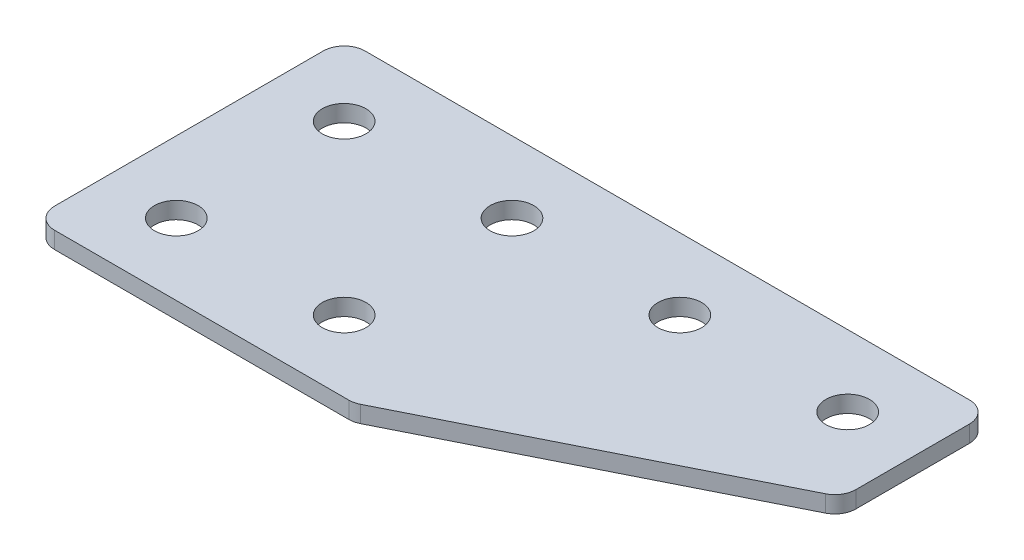
ISO-10303-21;
HEADER;
FILE_DESCRIPTION(('STEP AP214'),'2;1');
FILE_NAME('part.step','',(''),(''),'','','');
FILE_SCHEMA(('AUTOMOTIVE_DESIGN { 1 0 10303 214 1 1 1 1 }'));
ENDSEC;
DATA;
#1=APPLICATION_CONTEXT('core data for automotive mechanical design processes');
#2=APPLICATION_PROTOCOL_DEFINITION('international standard','automotive_design',2000,#1);
#3=PRODUCT_CONTEXT('',#1,'mechanical');
#4=PRODUCT('Part','Part','',(#3));
#5=PRODUCT_RELATED_PRODUCT_CATEGORY('part','',(#4));
#6=PRODUCT_DEFINITION_FORMATION('','',#4);
#7=PRODUCT_DEFINITION_CONTEXT('part definition',#1,'design');
#8=PRODUCT_DEFINITION('design','',#6,#7);
#9=PRODUCT_DEFINITION_SHAPE('','',#8);
#10=(LENGTH_UNIT() NAMED_UNIT(*) SI_UNIT(.MILLI.,.METRE.));
#11=(NAMED_UNIT(*) PLANE_ANGLE_UNIT() SI_UNIT($,.RADIAN.));
#12=(NAMED_UNIT(*) SI_UNIT($,.STERADIAN.) SOLID_ANGLE_UNIT());
#13=UNCERTAINTY_MEASURE_WITH_UNIT(LENGTH_MEASURE(1.E-05),#10,'distance_accuracy_value','');
#14=(GEOMETRIC_REPRESENTATION_CONTEXT(3) GLOBAL_UNCERTAINTY_ASSIGNED_CONTEXT((#13)) GLOBAL_UNIT_ASSIGNED_CONTEXT((#10,
#11,#12)) REPRESENTATION_CONTEXT('',''));
#15=CARTESIAN_POINT('',(0.,0.,0.));
#16=DIRECTION('',(0.,0.,1.));
#17=DIRECTION('',(1.,0.,0.));
#18=AXIS2_PLACEMENT_3D('',#15,#16,#17);
#19=CARTESIAN_POINT('',(-21.2079098669346,0.841431359650869,-10.6332222330343));
#20=DIRECTION('',(0.,-1.,0.));
#21=DIRECTION('',(0.,0.,-1.));
#22=AXIS2_PLACEMENT_3D('',#19,#20,#21);
#23=PLANE('',#22);
#24=CARTESIAN_POINT('',(-11.2079098669345,0.841431359650869,9.36677776696574));
#25=DIRECTION('',(0.,1.,0.));
#26=DIRECTION('',(0.,0.,1.));
#27=AXIS2_PLACEMENT_3D('',#24,#25,#26);
#28=CIRCLE('',#27,2.6);
#29=CARTESIAN_POINT('',(-11.2079098669345,0.841431359650869,11.9667777669657));
#30=VERTEX_POINT('',#29);
#31=EDGE_CURVE('E253',#30,#30,#28,.T.);
#32=ORIENTED_EDGE('',*,*,#31,.T.);
#33=EDGE_LOOP('',(#32));
#34=FACE_BOUND('',#33,.T.);
#35=CARTESIAN_POINT('',(-31.2079098669346,0.841431359650869,9.36677776696574));
#36=DIRECTION('',(0.,1.,0.));
#37=DIRECTION('',(0.,0.,1.));
#38=AXIS2_PLACEMENT_3D('',#35,#36,#37);
#39=CIRCLE('',#38,2.6);
#40=CARTESIAN_POINT('',(-31.2079098669346,0.841431359650869,11.9667777669657));
#41=VERTEX_POINT('',#40);
#42=EDGE_CURVE('E261',#41,#41,#39,.T.);
#43=ORIENTED_EDGE('',*,*,#42,.T.);
#44=EDGE_LOOP('',(#43));
#45=FACE_BOUND('',#44,.T.);
#46=CARTESIAN_POINT('',(28.7920901330654,0.841431359650869,-10.6332222330343));
#47=DIRECTION('',(0.,1.,0.));
#48=DIRECTION('',(0.,0.,1.));
#49=AXIS2_PLACEMENT_3D('',#46,#47,#48);
#50=CIRCLE('',#49,2.6);
#51=CARTESIAN_POINT('',(28.7920901330654,0.841431359650869,-8.03322223303427));
#52=VERTEX_POINT('',#51);
#53=EDGE_CURVE('E267',#52,#52,#50,.T.);
#54=ORIENTED_EDGE('',*,*,#53,.T.);
#55=EDGE_LOOP('',(#54));
#56=FACE_BOUND('',#55,.T.);
#57=CARTESIAN_POINT('',(8.79209013306545,0.841431359650869,-10.6332222330343));
#58=DIRECTION('',(0.,1.,0.));
#59=DIRECTION('',(0.,0.,1.));
#60=AXIS2_PLACEMENT_3D('',#57,#58,#59);
#61=CIRCLE('',#60,2.6);
#62=CARTESIAN_POINT('',(8.79209013306545,0.841431359650869,-8.03322223303427));
#63=VERTEX_POINT('',#62);
#64=EDGE_CURVE('E273',#63,#63,#61,.T.);
#65=ORIENTED_EDGE('',*,*,#64,.T.);
#66=EDGE_LOOP('',(#65));
#67=FACE_BOUND('',#66,.T.);
#68=CARTESIAN_POINT('',(-11.2079098669345,0.841431359650869,-10.6332222330343));
#69=DIRECTION('',(0.,1.,0.));
#70=DIRECTION('',(0.,0.,1.));
#71=AXIS2_PLACEMENT_3D('',#68,#69,#70);
#72=CIRCLE('',#71,2.6);
#73=CARTESIAN_POINT('',(-11.2079098669345,0.841431359650869,-8.03322223303426));
#74=VERTEX_POINT('',#73);
#75=EDGE_CURVE('E279',#74,#74,#72,.T.);
#76=ORIENTED_EDGE('',*,*,#75,.T.);
#77=EDGE_LOOP('',(#76));
#78=FACE_BOUND('',#77,.T.);
#79=CARTESIAN_POINT('',(-31.2079098669346,0.841431359650869,-10.6332222330343));
#80=DIRECTION('',(0.,1.,0.));
#81=DIRECTION('',(0.,0.,1.));
#82=AXIS2_PLACEMENT_3D('',#79,#80,#81);
#83=CIRCLE('',#82,2.6);
#84=CARTESIAN_POINT('',(-31.2079098669346,0.841431359650869,-8.03322223303426));
#85=VERTEX_POINT('',#84);
#86=EDGE_CURVE('E176',#85,#85,#83,.T.);
#87=ORIENTED_EDGE('',*,*,#86,.T.);
#88=EDGE_LOOP('',(#87));
#89=FACE_BOUND('',#88,.T.);
#90=DIRECTION('',(1.,0.,0.));
#91=VECTOR('',#90,1.);
#92=CARTESIAN_POINT('',(-39.7079098669346,0.841431359650869,17.8667777669657));
#93=LINE('',#92,#91);
#94=CARTESIAN_POINT('',(-37.2079098669346,0.841431359650869,17.8667777669657));
#95=VERTEX_POINT('',#94);
#96=CARTESIAN_POINT('',(-2.15218177693365,0.841431359650869,17.8667777669657));
#97=VERTEX_POINT('',#96);
#98=EDGE_CURVE('E165',#95,#97,#93,.T.);
#99=ORIENTED_EDGE('',*,*,#98,.F.);
#100=CARTESIAN_POINT('',(-37.2079098669346,0.841431359650869,15.3667777669657));
#101=DIRECTION('',(0.,-1.,0.));
#102=DIRECTION('',(0.,0.,-1.));
#103=AXIS2_PLACEMENT_3D('',#100,#101,#102);
#104=CIRCLE('',#103,2.5);
#105=CARTESIAN_POINT('',(-39.7079098669346,0.841431359650869,15.3667777669657));
#106=VERTEX_POINT('',#105);
#107=EDGE_CURVE('E146',#95,#106,#104,.T.);
#108=ORIENTED_EDGE('',*,*,#107,.T.);
#109=DIRECTION('',(0.,0.,1.));
#110=VECTOR('',#109,1.);
#111=CARTESIAN_POINT('',(-39.7079098669346,0.841431359650869,-19.1332222330343));
#112=LINE('',#111,#110);
#113=CARTESIAN_POINT('',(-39.7079098669346,0.841431359650869,-16.6332222330343));
#114=VERTEX_POINT('',#113);
#115=EDGE_CURVE('E163',#114,#106,#112,.T.);
#116=ORIENTED_EDGE('',*,*,#115,.F.);
#117=CARTESIAN_POINT('',(-37.2079098669346,0.841431359650869,-16.6332222330343));
#118=DIRECTION('',(0.,-1.,0.));
#119=DIRECTION('',(0.,0.,-1.));
#120=AXIS2_PLACEMENT_3D('',#117,#118,#119);
#121=CIRCLE('',#120,2.5);
#122=CARTESIAN_POINT('',(-37.2079098669346,0.841431359650869,-19.1332222330343));
#123=VERTEX_POINT('',#122);
#124=EDGE_CURVE('E117',#114,#123,#121,.T.);
#125=ORIENTED_EDGE('',*,*,#124,.T.);
#126=DIRECTION('',(-1.,0.,0.));
#127=VECTOR('',#126,1.);
#128=CARTESIAN_POINT('',(37.2920901330654,0.841431359650869,-19.1332222330343));
#129=LINE('',#128,#127);
#130=CARTESIAN_POINT('',(34.7920901330654,0.841431359650869,-19.1332222330343));
#131=VERTEX_POINT('',#130);
#132=EDGE_CURVE('E161',#131,#123,#129,.T.);
#133=ORIENTED_EDGE('',*,*,#132,.F.);
#134=CARTESIAN_POINT('',(34.7920901330654,0.841431359650869,-16.6332222330343));
#135=DIRECTION('',(0.,-1.,0.));
#136=DIRECTION('',(0.,0.,-1.));
#137=AXIS2_PLACEMENT_3D('',#134,#135,#136);
#138=CIRCLE('',#137,2.5);
#139=CARTESIAN_POINT('',(37.2920901330654,0.841431359650869,-16.6332222330343));
#140=VERTEX_POINT('',#139);
#141=EDGE_CURVE('E141',#131,#140,#138,.T.);
#142=ORIENTED_EDGE('',*,*,#141,.T.);
#143=DIRECTION('',(0.,0.,-1.));
#144=VECTOR('',#143,1.);
#145=CARTESIAN_POINT('',(37.2920901330654,0.841431359650869,-1.56027321615907));
#146=LINE('',#145,#144);
#147=CARTESIAN_POINT('',(37.2920901330654,0.841431359650869,-3.10535818803381));
#148=VERTEX_POINT('',#147);
#149=EDGE_CURVE('E118',#148,#140,#146,.T.);
#150=ORIENTED_EDGE('',*,*,#149,.F.);
#151=CARTESIAN_POINT('',(34.7920901330654,0.841431359650869,-3.10535818803381));
#152=DIRECTION('',(0.,-1.,0.));
#153=DIRECTION('',(0.,0.,-1.));
#154=AXIS2_PLACEMENT_3D('',#151,#152,#153);
#155=CIRCLE('',#154,2.5);
#156=CARTESIAN_POINT('',(35.9101241218152,0.841431359650869,-0.869290210534016));
#157=VERTEX_POINT('',#156);
#158=EDGE_CURVE('E31',#148,#157,#155,.T.);
#159=ORIENTED_EDGE('',*,*,#158,.T.);
#160=DIRECTION('',(0.894427190999916,0.,-0.447213595499958));
#161=VECTOR('',#160,1.);
#162=CARTESIAN_POINT('',(-1.56201183318416,0.841431359650869,17.8667777669657));
#163=LINE('',#162,#161);
#164=CARTESIAN_POINT('',(-1.03414778818375,0.841431359650869,17.6028457444655));
#165=VERTEX_POINT('',#164);
#166=EDGE_CURVE('E122',#165,#157,#163,.T.);
#167=ORIENTED_EDGE('',*,*,#166,.F.);
#168=CARTESIAN_POINT('',(-2.15218177693365,0.841431359650869,15.3667777669657));
#169=DIRECTION('',(0.,-1.,0.));
#170=DIRECTION('',(0.,0.,-1.));
#171=AXIS2_PLACEMENT_3D('',#168,#169,#170);
#172=CIRCLE('',#171,2.5);
#173=EDGE_CURVE('E144',#165,#97,#172,.T.);
#174=ORIENTED_EDGE('',*,*,#173,.T.);
#175=EDGE_LOOP('',(#99,#108,#116,#125,#133,#142,#150,#159,#167,#174));
#176=FACE_BOUND('',#175,.T.);
#177=ADVANCED_FACE('F16',(#34,#45,#56,#67,#78,#89,#176),#23,.T.);
#178=CARTESIAN_POINT('',(37.2920901330654,0.841431359650869,-19.1332222330343));
#179=DIRECTION('',(0.,0.,-1.));
#180=DIRECTION('',(-1.,0.,0.));
#181=AXIS2_PLACEMENT_3D('',#178,#179,#180);
#182=PLANE('',#181);
#183=DIRECTION('',(-1.,0.,0.));
#184=VECTOR('',#183,1.);
#185=CARTESIAN_POINT('',(37.2920901330654,2.84143135965087,-19.1332222330343));
#186=LINE('',#185,#184);
#187=CARTESIAN_POINT('',(34.7920901330654,2.84143135965087,-19.1332222330343));
#188=VERTEX_POINT('',#187);
#189=CARTESIAN_POINT('',(-37.2079098669346,2.84143135965087,-19.1332222330343));
#190=VERTEX_POINT('',#189);
#191=EDGE_CURVE('E99',#188,#190,#186,.T.);
#192=ORIENTED_EDGE('',*,*,#191,.F.);
#193=DIRECTION('',(0.,1.,0.));
#194=VECTOR('',#193,1.);
#195=CARTESIAN_POINT('',(34.7920901330654,0.841431359650869,-19.1332222330343));
#196=LINE('',#195,#194);
#197=EDGE_CURVE('E10',#188,#131,#196,.F.);
#198=ORIENTED_EDGE('',*,*,#197,.T.);
#199=ORIENTED_EDGE('',*,*,#132,.T.);
#200=DIRECTION('',(0.,1.,0.));
#201=VECTOR('',#200,1.);
#202=CARTESIAN_POINT('',(-37.2079098669346,0.841431359650869,-19.1332222330343));
#203=LINE('',#202,#201);
#204=EDGE_CURVE('E24',#123,#190,#203,.T.);
#205=ORIENTED_EDGE('',*,*,#204,.T.);
#206=EDGE_LOOP('',(#192,#198,#199,#205));
#207=FACE_BOUND('',#206,.T.);
#208=ADVANCED_FACE('F158',(#207),#182,.T.);
#209=CARTESIAN_POINT('',(37.2920901330654,0.841431359650869,-1.56027321615907));
#210=DIRECTION('',(1.,0.,0.));
#211=DIRECTION('',(0.,0.,-1.));
#212=AXIS2_PLACEMENT_3D('',#209,#210,#211);
#213=PLANE('',#212);
#214=DIRECTION('',(0.,0.,-1.));
#215=VECTOR('',#214,1.);
#216=CARTESIAN_POINT('',(37.2920901330654,2.84143135965087,-1.56027321615907));
#217=LINE('',#216,#215);
#218=CARTESIAN_POINT('',(37.2920901330654,2.84143135965087,-3.10535818803381));
#219=VERTEX_POINT('',#218);
#220=CARTESIAN_POINT('',(37.2920901330654,2.84143135965087,-16.6332222330343));
#221=VERTEX_POINT('',#220);
#222=EDGE_CURVE('E125',#219,#221,#217,.T.);
#223=ORIENTED_EDGE('',*,*,#222,.F.);
#224=DIRECTION('',(0.,1.,0.));
#225=VECTOR('',#224,1.);
#226=CARTESIAN_POINT('',(37.2920901330654,0.841431359650869,-3.10535818803381));
#227=LINE('',#226,#225);
#228=EDGE_CURVE('E155',#219,#148,#227,.F.);
#229=ORIENTED_EDGE('',*,*,#228,.T.);
#230=ORIENTED_EDGE('',*,*,#149,.T.);
#231=DIRECTION('',(0.,1.,0.));
#232=VECTOR('',#231,1.);
#233=CARTESIAN_POINT('',(37.2920901330654,0.841431359650869,-16.6332222330343));
#234=LINE('',#233,#232);
#235=EDGE_CURVE('E152',#140,#221,#234,.T.);
#236=ORIENTED_EDGE('',*,*,#235,.T.);
#237=EDGE_LOOP('',(#223,#229,#230,#236));
#238=FACE_BOUND('',#237,.T.);
#239=ADVANCED_FACE('F212',(#238),#213,.T.);
#240=CARTESIAN_POINT('',(-1.56201183318416,0.841431359650869,17.8667777669657));
#241=DIRECTION('',(0.447213595499958,0.,0.894427190999916));
#242=DIRECTION('',(0.894427190999916,0.,-0.447213595499958));
#243=AXIS2_PLACEMENT_3D('',#240,#241,#242);
#244=PLANE('',#243);
#245=DIRECTION('',(0.894427190999916,0.,-0.447213595499958));
#246=VECTOR('',#245,1.);
#247=CARTESIAN_POINT('',(-1.56201183318416,2.84143135965087,17.8667777669657));
#248=LINE('',#247,#246);
#249=CARTESIAN_POINT('',(-1.03414778818375,2.84143135965087,17.6028457444655));
#250=VERTEX_POINT('',#249);
#251=CARTESIAN_POINT('',(35.9101241218152,2.84143135965087,-0.869290210534016));
#252=VERTEX_POINT('',#251);
#253=EDGE_CURVE('E168',#250,#252,#248,.T.);
#254=ORIENTED_EDGE('',*,*,#253,.F.);
#255=DIRECTION('',(0.,1.,0.));
#256=VECTOR('',#255,1.);
#257=CARTESIAN_POINT('',(-1.03414778818375,0.841431359650869,17.6028457444655));
#258=LINE('',#257,#256);
#259=EDGE_CURVE('E38',#250,#165,#258,.F.);
#260=ORIENTED_EDGE('',*,*,#259,.T.);
#261=ORIENTED_EDGE('',*,*,#166,.T.);
#262=DIRECTION('',(0.,1.,0.));
#263=VECTOR('',#262,1.);
#264=CARTESIAN_POINT('',(35.9101241218153,0.841431359650869,-0.869290210534016));
#265=LINE('',#264,#263);
#266=EDGE_CURVE('E148',#157,#252,#265,.T.);
#267=ORIENTED_EDGE('',*,*,#266,.T.);
#268=EDGE_LOOP('',(#254,#260,#261,#267));
#269=FACE_BOUND('',#268,.T.);
#270=ADVANCED_FACE('F181',(#269),#244,.T.);
#271=CARTESIAN_POINT('',(-39.7079098669346,0.841431359650869,17.8667777669657));
#272=DIRECTION('',(0.,0.,1.));
#273=DIRECTION('',(1.,0.,0.));
#274=AXIS2_PLACEMENT_3D('',#271,#272,#273);
#275=PLANE('',#274);
#276=DIRECTION('',(1.,0.,0.));
#277=VECTOR('',#276,1.);
#278=CARTESIAN_POINT('',(-39.7079098669346,2.84143135965087,17.8667777669657));
#279=LINE('',#278,#277);
#280=CARTESIAN_POINT('',(-37.2079098669346,2.84143135965087,17.8667777669657));
#281=VERTEX_POINT('',#280);
#282=CARTESIAN_POINT('',(-2.15218177693365,2.84143135965087,17.8667777669657));
#283=VERTEX_POINT('',#282);
#284=EDGE_CURVE('E114',#281,#283,#279,.T.);
#285=ORIENTED_EDGE('',*,*,#284,.F.);
#286=DIRECTION('',(0.,1.,0.));
#287=VECTOR('',#286,1.);
#288=CARTESIAN_POINT('',(-37.2079098669346,0.841431359650869,17.8667777669657));
#289=LINE('',#288,#287);
#290=EDGE_CURVE('E138',#281,#95,#289,.F.);
#291=ORIENTED_EDGE('',*,*,#290,.T.);
#292=ORIENTED_EDGE('',*,*,#98,.T.);
#293=DIRECTION('',(0.,1.,0.));
#294=VECTOR('',#293,1.);
#295=CARTESIAN_POINT('',(-2.15218177693365,0.841431359650869,17.8667777669657));
#296=LINE('',#295,#294);
#297=EDGE_CURVE('E135',#97,#283,#296,.T.);
#298=ORIENTED_EDGE('',*,*,#297,.T.);
#299=EDGE_LOOP('',(#285,#291,#292,#298));
#300=FACE_BOUND('',#299,.T.);
#301=ADVANCED_FACE('F191',(#300),#275,.T.);
#302=CARTESIAN_POINT('',(-39.7079098669346,0.841431359650869,-19.1332222330343));
#303=DIRECTION('',(-1.,0.,0.));
#304=DIRECTION('',(0.,0.,1.));
#305=AXIS2_PLACEMENT_3D('',#302,#303,#304);
#306=PLANE('',#305);
#307=ORIENTED_EDGE('',*,*,#115,.T.);
#308=DIRECTION('',(0.,1.,0.));
#309=VECTOR('',#308,1.);
#310=CARTESIAN_POINT('',(-39.7079098669346,0.841431359650869,15.3667777669657));
#311=LINE('',#310,#309);
#312=CARTESIAN_POINT('',(-39.7079098669346,2.84143135965087,15.3667777669657));
#313=VERTEX_POINT('',#312);
#314=EDGE_CURVE('E105',#106,#313,#311,.T.);
#315=ORIENTED_EDGE('',*,*,#314,.T.);
#316=DIRECTION('',(0.,0.,1.));
#317=VECTOR('',#316,1.);
#318=CARTESIAN_POINT('',(-39.7079098669346,2.84143135965087,-19.1332222330343));
#319=LINE('',#318,#317);
#320=CARTESIAN_POINT('',(-39.7079098669346,2.84143135965087,-16.6332222330343));
#321=VERTEX_POINT('',#320);
#322=EDGE_CURVE('E97',#321,#313,#319,.T.);
#323=ORIENTED_EDGE('',*,*,#322,.F.);
#324=DIRECTION('',(0.,1.,0.));
#325=VECTOR('',#324,1.);
#326=CARTESIAN_POINT('',(-39.7079098669346,0.841431359650869,-16.6332222330343));
#327=LINE('',#326,#325);
#328=EDGE_CURVE('E111',#321,#114,#327,.F.);
#329=ORIENTED_EDGE('',*,*,#328,.T.);
#330=EDGE_LOOP('',(#307,#315,#323,#329));
#331=FACE_BOUND('',#330,.T.);
#332=ADVANCED_FACE('F110',(#331),#306,.T.);
#333=CARTESIAN_POINT('',(-21.2079098669346,2.84143135965087,-10.6332222330343));
#334=DIRECTION('',(0.,-1.,0.));
#335=DIRECTION('',(0.,0.,-1.));
#336=AXIS2_PLACEMENT_3D('',#333,#334,#335);
#337=PLANE('',#336);
#338=CARTESIAN_POINT('',(-11.2079098669345,2.84143135965087,9.36677776696574));
#339=DIRECTION('',(0.,1.,0.));
#340=DIRECTION('',(0.,0.,1.));
#341=AXIS2_PLACEMENT_3D('',#338,#339,#340);
#342=CIRCLE('',#341,2.6);
#343=CARTESIAN_POINT('',(-11.2079098669345,2.84143135965087,11.9667777669657));
#344=VERTEX_POINT('',#343);
#345=EDGE_CURVE('E256',#344,#344,#342,.T.);
#346=ORIENTED_EDGE('',*,*,#345,.F.);
#347=EDGE_LOOP('',(#346));
#348=FACE_BOUND('',#347,.T.);
#349=CARTESIAN_POINT('',(-31.2079098669346,2.84143135965087,9.36677776696574));
#350=DIRECTION('',(0.,1.,0.));
#351=DIRECTION('',(0.,0.,1.));
#352=AXIS2_PLACEMENT_3D('',#349,#350,#351);
#353=CIRCLE('',#352,2.6);
#354=CARTESIAN_POINT('',(-31.2079098669346,2.84143135965087,11.9667777669657));
#355=VERTEX_POINT('',#354);
#356=EDGE_CURVE('E258',#355,#355,#353,.T.);
#357=ORIENTED_EDGE('',*,*,#356,.F.);
#358=EDGE_LOOP('',(#357));
#359=FACE_BOUND('',#358,.T.);
#360=CARTESIAN_POINT('',(28.7920901330654,2.84143135965087,-10.6332222330343));
#361=DIRECTION('',(0.,1.,0.));
#362=DIRECTION('',(0.,0.,1.));
#363=AXIS2_PLACEMENT_3D('',#360,#361,#362);
#364=CIRCLE('',#363,2.6);
#365=CARTESIAN_POINT('',(28.7920901330654,2.84143135965087,-8.03322223303427));
#366=VERTEX_POINT('',#365);
#367=EDGE_CURVE('E264',#366,#366,#364,.T.);
#368=ORIENTED_EDGE('',*,*,#367,.F.);
#369=EDGE_LOOP('',(#368));
#370=FACE_BOUND('',#369,.T.);
#371=CARTESIAN_POINT('',(8.79209013306545,2.84143135965087,-10.6332222330343));
#372=DIRECTION('',(0.,1.,0.));
#373=DIRECTION('',(0.,0.,1.));
#374=AXIS2_PLACEMENT_3D('',#371,#372,#373);
#375=CIRCLE('',#374,2.6);
#376=CARTESIAN_POINT('',(8.79209013306545,2.84143135965087,-8.03322223303427));
#377=VERTEX_POINT('',#376);
#378=EDGE_CURVE('E270',#377,#377,#375,.T.);
#379=ORIENTED_EDGE('',*,*,#378,.F.);
#380=EDGE_LOOP('',(#379));
#381=FACE_BOUND('',#380,.T.);
#382=CARTESIAN_POINT('',(-11.2079098669345,2.84143135965087,-10.6332222330343));
#383=DIRECTION('',(0.,1.,0.));
#384=DIRECTION('',(0.,0.,1.));
#385=AXIS2_PLACEMENT_3D('',#382,#383,#384);
#386=CIRCLE('',#385,2.6);
#387=CARTESIAN_POINT('',(-11.2079098669345,2.84143135965087,-8.03322223303426));
#388=VERTEX_POINT('',#387);
#389=EDGE_CURVE('E276',#388,#388,#386,.T.);
#390=ORIENTED_EDGE('',*,*,#389,.F.);
#391=EDGE_LOOP('',(#390));
#392=FACE_BOUND('',#391,.T.);
#393=CARTESIAN_POINT('',(-31.2079098669346,2.84143135965087,-10.6332222330343));
#394=DIRECTION('',(0.,1.,0.));
#395=DIRECTION('',(0.,0.,1.));
#396=AXIS2_PLACEMENT_3D('',#393,#394,#395);
#397=CIRCLE('',#396,2.6);
#398=CARTESIAN_POINT('',(-31.2079098669346,2.84143135965087,-8.03322223303426));
#399=VERTEX_POINT('',#398);
#400=EDGE_CURVE('E170',#399,#399,#397,.T.);
#401=ORIENTED_EDGE('',*,*,#400,.F.);
#402=EDGE_LOOP('',(#401));
#403=FACE_BOUND('',#402,.T.);
#404=ORIENTED_EDGE('',*,*,#322,.T.);
#405=CARTESIAN_POINT('',(-37.2079098669346,2.84143135965087,15.3667777669657));
#406=DIRECTION('',(0.,-1.,0.));
#407=DIRECTION('',(0.,0.,-1.));
#408=AXIS2_PLACEMENT_3D('',#405,#406,#407);
#409=CIRCLE('',#408,2.5);
#410=EDGE_CURVE('E133',#313,#281,#409,.F.);
#411=ORIENTED_EDGE('',*,*,#410,.T.);
#412=ORIENTED_EDGE('',*,*,#284,.T.);
#413=CARTESIAN_POINT('',(-2.15218177693365,2.84143135965087,15.3667777669657));
#414=DIRECTION('',(0.,-1.,0.));
#415=DIRECTION('',(0.,0.,-1.));
#416=AXIS2_PLACEMENT_3D('',#413,#414,#415);
#417=CIRCLE('',#416,2.5);
#418=EDGE_CURVE('E131',#283,#250,#417,.F.);
#419=ORIENTED_EDGE('',*,*,#418,.T.);
#420=ORIENTED_EDGE('',*,*,#253,.T.);
#421=CARTESIAN_POINT('',(34.7920901330654,2.84143135965087,-3.10535818803381));
#422=DIRECTION('',(0.,-1.,0.));
#423=DIRECTION('',(0.,0.,-1.));
#424=AXIS2_PLACEMENT_3D('',#421,#422,#423);
#425=CIRCLE('',#424,2.5);
#426=EDGE_CURVE('E129',#252,#219,#425,.F.);
#427=ORIENTED_EDGE('',*,*,#426,.T.);
#428=ORIENTED_EDGE('',*,*,#222,.T.);
#429=CARTESIAN_POINT('',(34.7920901330654,2.84143135965087,-16.6332222330343));
#430=DIRECTION('',(0.,-1.,0.));
#431=DIRECTION('',(0.,0.,-1.));
#432=AXIS2_PLACEMENT_3D('',#429,#430,#431);
#433=CIRCLE('',#432,2.5);
#434=EDGE_CURVE('E104',#221,#188,#433,.F.);
#435=ORIENTED_EDGE('',*,*,#434,.T.);
#436=ORIENTED_EDGE('',*,*,#191,.T.);
#437=CARTESIAN_POINT('',(-37.2079098669346,2.84143135965087,-16.6332222330343));
#438=DIRECTION('',(0.,-1.,0.));
#439=DIRECTION('',(0.,0.,-1.));
#440=AXIS2_PLACEMENT_3D('',#437,#438,#439);
#441=CIRCLE('',#440,2.5);
#442=EDGE_CURVE('E94',#190,#321,#441,.F.);
#443=ORIENTED_EDGE('',*,*,#442,.T.);
#444=EDGE_LOOP('',(#404,#411,#412,#419,#420,#427,#428,#435,#436,#443));
#445=FACE_BOUND('',#444,.T.);
#446=ADVANCED_FACE('F96',(#348,#359,#370,#381,#392,#403,#445),#337,.F.);
#447=CARTESIAN_POINT('',(-37.2079098669346,0.841431359650869,15.3667777669657));
#448=DIRECTION('',(0.,1.,0.));
#449=DIRECTION('',(0.,0.,1.));
#450=AXIS2_PLACEMENT_3D('',#447,#448,#449);
#451=CYLINDRICAL_SURFACE('',#450,2.5);
#452=ORIENTED_EDGE('',*,*,#107,.F.);
#453=ORIENTED_EDGE('',*,*,#290,.F.);
#454=ORIENTED_EDGE('',*,*,#410,.F.);
#455=ORIENTED_EDGE('',*,*,#314,.F.);
#456=EDGE_LOOP('',(#452,#453,#454,#455));
#457=FACE_BOUND('',#456,.T.);
#458=ADVANCED_FACE('F194',(#457),#451,.T.);
#459=CARTESIAN_POINT('',(-2.15218177693365,0.841431359650869,15.3667777669657));
#460=DIRECTION('',(0.,1.,0.));
#461=DIRECTION('',(0.,0.,1.));
#462=AXIS2_PLACEMENT_3D('',#459,#460,#461);
#463=CYLINDRICAL_SURFACE('',#462,2.5);
#464=ORIENTED_EDGE('',*,*,#173,.F.);
#465=ORIENTED_EDGE('',*,*,#259,.F.);
#466=ORIENTED_EDGE('',*,*,#418,.F.);
#467=ORIENTED_EDGE('',*,*,#297,.F.);
#468=EDGE_LOOP('',(#464,#465,#466,#467));
#469=FACE_BOUND('',#468,.T.);
#470=ADVANCED_FACE('F185',(#469),#463,.T.);
#471=CARTESIAN_POINT('',(34.7920901330654,0.841431359650869,-3.10535818803381));
#472=DIRECTION('',(0.,1.,0.));
#473=DIRECTION('',(0.,0.,1.));
#474=AXIS2_PLACEMENT_3D('',#471,#472,#473);
#475=CYLINDRICAL_SURFACE('',#474,2.5);
#476=ORIENTED_EDGE('',*,*,#158,.F.);
#477=ORIENTED_EDGE('',*,*,#228,.F.);
#478=ORIENTED_EDGE('',*,*,#426,.F.);
#479=ORIENTED_EDGE('',*,*,#266,.F.);
#480=EDGE_LOOP('',(#476,#477,#478,#479));
#481=FACE_BOUND('',#480,.T.);
#482=ADVANCED_FACE('F202',(#481),#475,.T.);
#483=CARTESIAN_POINT('',(34.7920901330654,0.841431359650869,-16.6332222330343));
#484=DIRECTION('',(0.,1.,0.));
#485=DIRECTION('',(0.,0.,1.));
#486=AXIS2_PLACEMENT_3D('',#483,#484,#485);
#487=CYLINDRICAL_SURFACE('',#486,2.5);
#488=ORIENTED_EDGE('',*,*,#141,.F.);
#489=ORIENTED_EDGE('',*,*,#197,.F.);
#490=ORIENTED_EDGE('',*,*,#434,.F.);
#491=ORIENTED_EDGE('',*,*,#235,.F.);
#492=EDGE_LOOP('',(#488,#489,#490,#491));
#493=FACE_BOUND('',#492,.T.);
#494=ADVANCED_FACE('F337',(#493),#487,.T.);
#495=CARTESIAN_POINT('',(-37.2079098669346,0.841431359650869,-16.6332222330343));
#496=DIRECTION('',(0.,1.,0.));
#497=DIRECTION('',(0.,0.,1.));
#498=AXIS2_PLACEMENT_3D('',#495,#496,#497);
#499=CYLINDRICAL_SURFACE('',#498,2.5);
#500=ORIENTED_EDGE('',*,*,#124,.F.);
#501=ORIENTED_EDGE('',*,*,#328,.F.);
#502=ORIENTED_EDGE('',*,*,#442,.F.);
#503=ORIENTED_EDGE('',*,*,#204,.F.);
#504=EDGE_LOOP('',(#500,#501,#502,#503));
#505=FACE_BOUND('',#504,.T.);
#506=ADVANCED_FACE('F18',(#505),#499,.T.);
#507=CARTESIAN_POINT('',(-31.2079098669346,0.841431359650869,-10.6332222330343));
#508=DIRECTION('',(0.,1.,0.));
#509=DIRECTION('',(0.,0.,1.));
#510=AXIS2_PLACEMENT_3D('',#507,#508,#509);
#511=CYLINDRICAL_SURFACE('',#510,2.6);
#512=ORIENTED_EDGE('',*,*,#86,.F.);
#513=EDGE_LOOP('',(#512));
#514=FACE_BOUND('',#513,.T.);
#515=ORIENTED_EDGE('',*,*,#400,.T.);
#516=EDGE_LOOP('',(#515));
#517=FACE_BOUND('',#516,.T.);
#518=ADVANCED_FACE('F226',(#514,#517),#511,.F.);
#519=CARTESIAN_POINT('',(-11.2079098669345,0.841431359650869,-10.6332222330343));
#520=DIRECTION('',(0.,1.,0.));
#521=DIRECTION('',(0.,0.,1.));
#522=AXIS2_PLACEMENT_3D('',#519,#520,#521);
#523=CYLINDRICAL_SURFACE('',#522,2.6);
#524=ORIENTED_EDGE('',*,*,#75,.F.);
#525=EDGE_LOOP('',(#524));
#526=FACE_BOUND('',#525,.T.);
#527=ORIENTED_EDGE('',*,*,#389,.T.);
#528=EDGE_LOOP('',(#527));
#529=FACE_BOUND('',#528,.T.);
#530=ADVANCED_FACE('F229',(#526,#529),#523,.F.);
#531=CARTESIAN_POINT('',(8.79209013306545,0.841431359650869,-10.6332222330343));
#532=DIRECTION('',(0.,1.,0.));
#533=DIRECTION('',(0.,0.,1.));
#534=AXIS2_PLACEMENT_3D('',#531,#532,#533);
#535=CYLINDRICAL_SURFACE('',#534,2.6);
#536=ORIENTED_EDGE('',*,*,#64,.F.);
#537=EDGE_LOOP('',(#536));
#538=FACE_BOUND('',#537,.T.);
#539=ORIENTED_EDGE('',*,*,#378,.T.);
#540=EDGE_LOOP('',(#539));
#541=FACE_BOUND('',#540,.T.);
#542=ADVANCED_FACE('F233',(#538,#541),#535,.F.);
#543=CARTESIAN_POINT('',(28.7920901330654,0.841431359650869,-10.6332222330343));
#544=DIRECTION('',(0.,1.,0.));
#545=DIRECTION('',(0.,0.,1.));
#546=AXIS2_PLACEMENT_3D('',#543,#544,#545);
#547=CYLINDRICAL_SURFACE('',#546,2.6);
#548=ORIENTED_EDGE('',*,*,#53,.F.);
#549=EDGE_LOOP('',(#548));
#550=FACE_BOUND('',#549,.T.);
#551=ORIENTED_EDGE('',*,*,#367,.T.);
#552=EDGE_LOOP('',(#551));
#553=FACE_BOUND('',#552,.T.);
#554=ADVANCED_FACE('F237',(#550,#553),#547,.F.);
#555=CARTESIAN_POINT('',(-31.2079098669346,0.841431359650869,9.36677776696574));
#556=DIRECTION('',(0.,1.,0.));
#557=DIRECTION('',(0.,0.,1.));
#558=AXIS2_PLACEMENT_3D('',#555,#556,#557);
#559=CYLINDRICAL_SURFACE('',#558,2.6);
#560=ORIENTED_EDGE('',*,*,#42,.F.);
#561=EDGE_LOOP('',(#560));
#562=FACE_BOUND('',#561,.T.);
#563=ORIENTED_EDGE('',*,*,#356,.T.);
#564=EDGE_LOOP('',(#563));
#565=FACE_BOUND('',#564,.T.);
#566=ADVANCED_FACE('F241',(#562,#565),#559,.F.);
#567=CARTESIAN_POINT('',(-11.2079098669345,0.841431359650869,9.36677776696574));
#568=DIRECTION('',(0.,1.,0.));
#569=DIRECTION('',(0.,0.,1.));
#570=AXIS2_PLACEMENT_3D('',#567,#568,#569);
#571=CYLINDRICAL_SURFACE('',#570,2.6);
#572=ORIENTED_EDGE('',*,*,#31,.F.);
#573=EDGE_LOOP('',(#572));
#574=FACE_BOUND('',#573,.T.);
#575=ORIENTED_EDGE('',*,*,#345,.T.);
#576=EDGE_LOOP('',(#575));
#577=FACE_BOUND('',#576,.T.);
#578=ADVANCED_FACE('F245',(#574,#577),#571,.F.);
#579=CLOSED_SHELL('',(#177,#208,#239,#270,#301,#332,#446,#458,#470,#482,#494,#506,#518,#530,
#542,#554,#566,#578));
#580=MANIFOLD_SOLID_BREP('B1',#579);
#581=ADVANCED_BREP_SHAPE_REPRESENTATION('',(#18,#580),#14);
#582=SHAPE_DEFINITION_REPRESENTATION(#9,#581);
ENDSEC;
END-ISO-10303-21;
